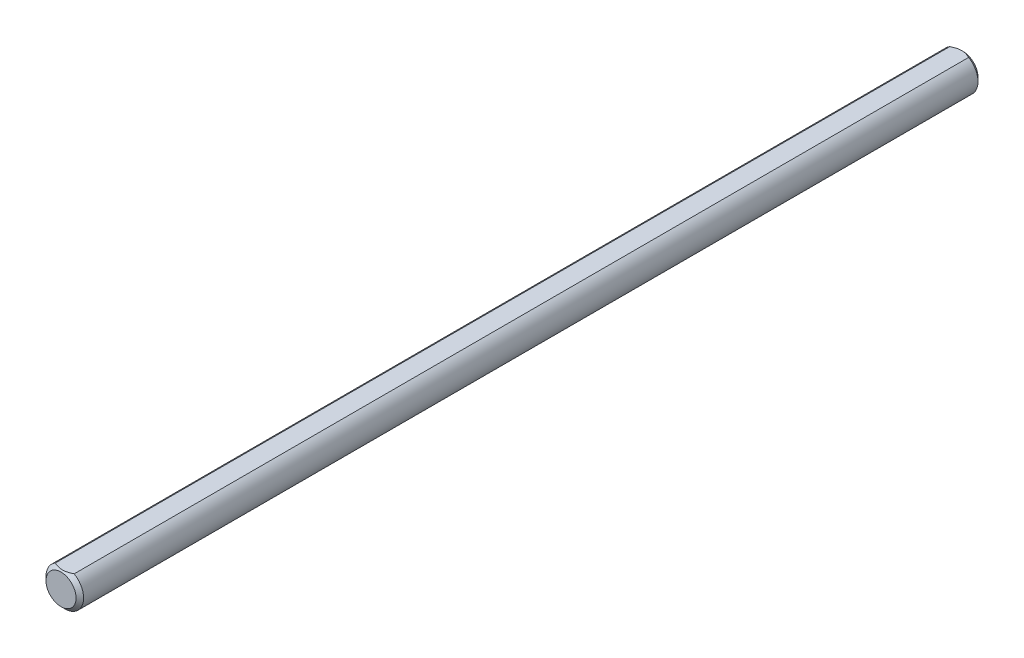
ISO-10303-21;
HEADER;
FILE_DESCRIPTION(('STEP AP214'),'2;1');
FILE_NAME('part.step','',(''),(''),'','','');
FILE_SCHEMA(('AUTOMOTIVE_DESIGN { 1 0 10303 214 1 1 1 1 }'));
ENDSEC;
DATA;
#1=APPLICATION_CONTEXT('core data for automotive mechanical design processes');
#2=APPLICATION_PROTOCOL_DEFINITION('international standard','automotive_design',2000,#1);
#3=PRODUCT_CONTEXT('',#1,'mechanical');
#4=PRODUCT('Part','Part','',(#3));
#5=PRODUCT_RELATED_PRODUCT_CATEGORY('part','',(#4));
#6=PRODUCT_DEFINITION_FORMATION('','',#4);
#7=PRODUCT_DEFINITION_CONTEXT('part definition',#1,'design');
#8=PRODUCT_DEFINITION('design','',#6,#7);
#9=PRODUCT_DEFINITION_SHAPE('','',#8);
#10=(LENGTH_UNIT() NAMED_UNIT(*) SI_UNIT(.MILLI.,.METRE.));
#11=(NAMED_UNIT(*) PLANE_ANGLE_UNIT() SI_UNIT($,.RADIAN.));
#12=(NAMED_UNIT(*) SI_UNIT($,.STERADIAN.) SOLID_ANGLE_UNIT());
#13=UNCERTAINTY_MEASURE_WITH_UNIT(LENGTH_MEASURE(1.E-05),#10,'distance_accuracy_value','');
#14=(GEOMETRIC_REPRESENTATION_CONTEXT(3) GLOBAL_UNCERTAINTY_ASSIGNED_CONTEXT((#13)) GLOBAL_UNIT_ASSIGNED_CONTEXT((#10,
#11,#12)) REPRESENTATION_CONTEXT('',''));
#15=CARTESIAN_POINT('',(0.,0.,0.));
#16=DIRECTION('',(0.,0.,1.));
#17=DIRECTION('',(1.,0.,0.));
#18=AXIS2_PLACEMENT_3D('',#15,#16,#17);
#19=CARTESIAN_POINT('',(0.,0.,152.4));
#20=DIRECTION('',(0.,0.,1.));
#21=DIRECTION('',(1.,0.,0.));
#22=AXIS2_PLACEMENT_3D('',#19,#20,#21);
#23=PLANE('',#22);
#24=CARTESIAN_POINT('',(0.,0.,152.4));
#25=DIRECTION('',(0.,0.,-1.));
#26=DIRECTION('',(-1.,0.,0.));
#27=AXIS2_PLACEMENT_3D('',#24,#25,#26);
#28=CIRCLE('',#27,5.08000000002085);
#29=CARTESIAN_POINT('',(-5.08000000002085,0.,152.4));
#30=VERTEX_POINT('',#29);
#31=EDGE_CURVE('E69',#30,#30,#28,.T.);
#32=ORIENTED_EDGE('',*,*,#31,.F.);
#33=EDGE_LOOP('',(#32));
#34=FACE_BOUND('',#33,.T.);
#35=ADVANCED_FACE('F18',(#34),#23,.T.);
#36=CARTESIAN_POINT('',(-3.175,5.49926131403118,-152.4));
#37=DIRECTION('',(0.,-1.,0.));
#38=DIRECTION('',(0.,0.,-1.));
#39=AXIS2_PLACEMENT_3D('',#36,#37,#38);
#40=PLANE('',#39);
#41=DIRECTION('',(0.,0.,-1.));
#42=VECTOR('',#41,1.);
#43=CARTESIAN_POINT('',(-3.175,5.49926131403118,152.4));
#44=LINE('',#43,#42);
#45=CARTESIAN_POINT('',(-3.17499999999278,5.49926131403118,151.129999999986));
#46=VERTEX_POINT('',#45);
#47=CARTESIAN_POINT('',(-3.17500000001147,5.49926131403118,-151.130000000033));
#48=VERTEX_POINT('',#47);
#49=EDGE_CURVE('E64',#46,#48,#44,.T.);
#50=ORIENTED_EDGE('',*,*,#49,.F.);
#51=CARTESIAN_POINT('',(3.17499999998556,5.49926131403118,151.129999999971));
#52=CARTESIAN_POINT('',(3.06582224123462,5.49926131403118,151.184580687039));
#53=CARTESIAN_POINT('',(2.95580532065341,5.49926131403118,151.237486270999));
#54=CARTESIAN_POINT('',(2.73392855594358,5.49926131403118,151.339437715292));
#55=CARTESIAN_POINT('',(2.62206774515666,5.49926131403118,151.388481467855));
#56=CARTESIAN_POINT('',(2.28243359865834,5.49926131403118,151.529473831666));
#57=CARTESIAN_POINT('',(2.05178528301454,5.49926131403118,151.614682188404));
#58=CARTESIAN_POINT('',(1.58666466159246,5.49926131403118,151.760595148938));
#59=CARTESIAN_POINT('',(1.35231120668174,5.49926131403118,151.82166731126));
#60=CARTESIAN_POINT('',(0.996928643232712,5.49926131403118,151.892312436909));
#61=CARTESIAN_POINT('',(0.877944621217785,5.49926131403118,151.912357514018));
#62=CARTESIAN_POINT('',(0.638969266910513,5.49926131403118,151.945006414228));
#63=CARTESIAN_POINT('',(0.51897808783385,5.49926131403118,151.957611349088));
#64=CARTESIAN_POINT('',(0.226565673507851,5.49926131403118,151.978745887672));
#65=CARTESIAN_POINT('',(0.0538293572723397,5.49926131403118,151.983179689027));
#66=CARTESIAN_POINT('',(-0.291331831873915,5.49926131403118,151.97573366432));
#67=CARTESIAN_POINT('',(-0.463756574413629,5.49926131403118,151.963848120183));
#68=CARTESIAN_POINT('',(-0.806980344369632,5.49926131403118,151.924464011978));
#69=CARTESIAN_POINT('',(-0.977777336704677,5.49926131403118,151.896947991802));
#70=CARTESIAN_POINT('',(-1.31643569556533,5.49926131403118,151.827798853937));
#71=CARTESIAN_POINT('',(-1.48429728619176,5.49926131403118,151.786166818915));
#72=CARTESIAN_POINT('',(-1.78226126433676,5.49926131403118,151.700523153688));
#73=CARTESIAN_POINT('',(-1.91302383332061,5.49926131403118,151.658765205639));
#74=CARTESIAN_POINT('',(-2.17220199281083,5.49926131403118,151.568521124862));
#75=CARTESIAN_POINT('',(-2.30061751242525,5.49926131403118,151.520034789285));
#76=CARTESIAN_POINT('',(-2.55469707230706,5.49926131403118,151.417420567503));
#77=CARTESIAN_POINT('',(-2.68036833830622,5.49926131403118,151.363310424551));
#78=CARTESIAN_POINT('',(-2.92938416729792,5.49926131403118,151.250158762808));
#79=CARTESIAN_POINT('',(-3.05273010019382,5.49926131403118,151.191120266261));
#80=CARTESIAN_POINT('',(-3.17499999998556,5.49926131403118,151.129999999971));
#81=B_SPLINE_CURVE_WITH_KNOTS('',3,(#51,#52,#53,#54,#55,#56,#57,#58,#59,#60,#61,#62,#63,#64,#65,
#66,#67,#68,#69,#70,#71,#72,#73,#74,#75,#76,#77,#78,#79,#80),.UNSPECIFIED.,.F.,.F.,(4,2,2,2,2,2,
2,2,2,2,2,2,2,2,4),(0.,0.366160918005269,0.732520319179626,1.46919363769064,2.19417107479299,
2.55594894319121,2.91767273846951,3.43524693043888,3.95300251953105,4.47133747776656,
4.98963268984637,5.40124433729582,5.81286839687703,6.22323107768345,6.63334393251401),.UNSPECIFIED.);
#82=CARTESIAN_POINT('',(3.17499999999278,5.49926131403118,151.129999999986));
#83=VERTEX_POINT('',#82);
#84=EDGE_CURVE('E21',#83,#46,#81,.T.);
#85=ORIENTED_EDGE('',*,*,#84,.F.);
#86=DIRECTION('',(0.,0.,-1.));
#87=VECTOR('',#86,1.);
#88=CARTESIAN_POINT('',(3.175,5.49926131403118,152.4));
#89=LINE('',#88,#87);
#90=CARTESIAN_POINT('',(3.17500000001147,5.49926131403118,-151.130000000033));
#91=VERTEX_POINT('',#90);
#92=EDGE_CURVE('E63',#91,#83,#89,.F.);
#93=ORIENTED_EDGE('',*,*,#92,.F.);
#94=CARTESIAN_POINT('',(-3.17500000002293,5.49926131403118,-151.130000000066));
#95=CARTESIAN_POINT('',(-3.06582224126242,5.49926131403118,-151.184580687134));
#96=CARTESIAN_POINT('',(-2.9558053206716,5.49926131403118,-151.237486271095));
#97=CARTESIAN_POINT('',(-2.73392855594251,5.49926131403118,-151.339437715387));
#98=CARTESIAN_POINT('',(-2.62206774514593,5.49926131403118,-151.388481467951));
#99=CARTESIAN_POINT('',(-2.2824335986185,5.49926131403118,-151.529473831759));
#100=CARTESIAN_POINT('',(-2.0517852829552,5.49926131403118,-151.614682188496));
#101=CARTESIAN_POINT('',(-1.58666466149496,5.49926131403118,-151.760595149023));
#102=CARTESIAN_POINT('',(-1.35231120656557,5.49926131403118,-151.821667311341));
#103=CARTESIAN_POINT('',(-0.996928643089042,5.49926131403118,-151.89231243698));
#104=CARTESIAN_POINT('',(-0.877944621065041,5.49926131403118,-151.912357514086));
#105=CARTESIAN_POINT('',(-0.638969266739833,5.49926131403118,-151.945006414289));
#106=CARTESIAN_POINT('',(-0.518978087654309,5.49926131403118,-151.957611349144));
#107=CARTESIAN_POINT('',(-0.226565673298807,5.49926131403118,-151.978745887719));
#108=CARTESIAN_POINT('',(-0.0538293570427386,5.49926131403118,-151.983179689068));
#109=CARTESIAN_POINT('',(0.291331832143883,5.49926131403118,-151.975733664344));
#110=CARTESIAN_POINT('',(0.463756574703407,5.49926131403118,-151.963848120199));
#111=CARTESIAN_POINT('',(0.806980344698153,5.49926131403118,-151.924464011973));
#112=CARTESIAN_POINT('',(0.97777733705213,5.49926131403118,-151.896947991787));
#113=CARTESIAN_POINT('',(1.31643569594981,5.49926131403118,-151.827798853899));
#114=CARTESIAN_POINT('',(1.48429728659434,5.49926131403118,-151.786166818865));
#115=CARTESIAN_POINT('',(1.7822612647224,5.49926131403118,-151.700523153631));
#116=CARTESIAN_POINT('',(1.91302383367218,5.49926131403118,-151.658765205589));
#117=CARTESIAN_POINT('',(2.17220199309568,5.49926131403118,-151.568521124831));
#118=CARTESIAN_POINT('',(2.30061751267745,5.49926131403118,-151.520034789266));
#119=CARTESIAN_POINT('',(2.55469707249533,5.49926131403118,-151.417420567511));
#120=CARTESIAN_POINT('',(2.68036833846322,5.49926131403118,-151.363310424574));
#121=CARTESIAN_POINT('',(2.92938416739397,5.49926131403118,-151.250158762866));
#122=CARTESIAN_POINT('',(3.05273010026019,5.49926131403118,-151.191120266336));
#123=CARTESIAN_POINT('',(3.17500000002293,5.49926131403118,-151.130000000066));
#124=B_SPLINE_CURVE_WITH_KNOTS('',3,(#94,#95,#96,#97,#98,#99,#100,#101,#102,#103,#104,#105,#106,
#107,#108,#109,#110,#111,#112,#113,#114,#115,#116,#117,#118,#119,#120,#121,#122,#123),
.UNSPECIFIED.,.F.,.F.,(4,2,2,2,2,2,2,2,2,2,2,2,2,2,4),(0.,0.366160918031475,0.732520319232085,
1.46919363779575,2.19417107494853,2.55594894337191,2.9176727386754,3.43524693070574,
3.95300251985896,4.47133747815565,4.98963269029662,5.40124433764236,5.81286839711964,
6.22323107782166,6.63334393254831),.UNSPECIFIED.);
#125=EDGE_CURVE('E66',#48,#91,#124,.T.);
#126=ORIENTED_EDGE('',*,*,#125,.F.);
#127=EDGE_LOOP('',(#50,#85,#93,#126));
#128=FACE_BOUND('',#127,.T.);
#129=ADVANCED_FACE('F62',(#128),#40,.F.);
#130=CARTESIAN_POINT('',(0.,0.,-152.4));
#131=DIRECTION('',(0.,0.,1.));
#132=DIRECTION('',(1.,0.,0.));
#133=AXIS2_PLACEMENT_3D('',#130,#131,#132);
#134=PLANE('',#133);
#135=CARTESIAN_POINT('',(0.,0.,-152.4));
#136=DIRECTION('',(0.,0.,1.));
#137=DIRECTION('',(1.,0.,0.));
#138=AXIS2_PLACEMENT_3D('',#135,#136,#137);
#139=CIRCLE('',#138,5.08000000002085);
#140=CARTESIAN_POINT('',(5.08000000002085,0.,-152.4));
#141=VERTEX_POINT('',#140);
#142=EDGE_CURVE('E58',#141,#141,#139,.T.);
#143=ORIENTED_EDGE('',*,*,#142,.F.);
#144=EDGE_LOOP('',(#143));
#145=FACE_BOUND('',#144,.T.);
#146=ADVANCED_FACE('F95',(#145),#134,.F.);
#147=CARTESIAN_POINT('',(0.,0.,151.13000000008));
#148=DIRECTION('',(0.,0.,-1.));
#149=DIRECTION('',(-1.,0.,0.));
#150=AXIS2_PLACEMENT_3D('',#147,#148,#149);
#151=CONICAL_SURFACE('',#150,6.34999999988395,0.785398163375069);
#152=ORIENTED_EDGE('',*,*,#31,.T.);
#153=EDGE_LOOP('',(#152));
#154=FACE_BOUND('',#153,.T.);
#155=CARTESIAN_POINT('',(0.,0.,151.13));
#156=DIRECTION('',(0.,0.,-1.));
#157=DIRECTION('',(-1.,0.,0.));
#158=AXIS2_PLACEMENT_3D('',#155,#156,#157);
#159=CIRCLE('',#158,6.35);
#160=EDGE_CURVE('E32',#83,#46,#159,.T.);
#161=ORIENTED_EDGE('',*,*,#160,.F.);
#162=ORIENTED_EDGE('',*,*,#84,.T.);
#163=EDGE_LOOP('',(#161,#162));
#164=FACE_BOUND('',#163,.T.);
#165=ADVANCED_FACE('F52',(#154,#164),#151,.T.);
#166=CARTESIAN_POINT('',(0.,0.,-151.13000000008));
#167=DIRECTION('',(0.,0.,1.));
#168=DIRECTION('',(1.,0.,0.));
#169=AXIS2_PLACEMENT_3D('',#166,#167,#168);
#170=CONICAL_SURFACE('',#169,6.34999999999764,0.785398163419828);
#171=ORIENTED_EDGE('',*,*,#142,.T.);
#172=EDGE_LOOP('',(#171));
#173=FACE_BOUND('',#172,.T.);
#174=CARTESIAN_POINT('',(0.,0.,-151.13));
#175=DIRECTION('',(0.,0.,-1.));
#176=DIRECTION('',(-1.,0.,0.));
#177=AXIS2_PLACEMENT_3D('',#174,#175,#176);
#178=CIRCLE('',#177,6.35);
#179=EDGE_CURVE('E11',#48,#91,#178,.F.);
#180=ORIENTED_EDGE('',*,*,#179,.F.);
#181=ORIENTED_EDGE('',*,*,#125,.T.);
#182=EDGE_LOOP('',(#180,#181));
#183=FACE_BOUND('',#182,.T.);
#184=ADVANCED_FACE('F88',(#173,#183),#170,.T.);
#185=CARTESIAN_POINT('',(0.,0.,152.4));
#186=DIRECTION('',(0.,0.,-1.));
#187=DIRECTION('',(-1.,0.,0.));
#188=AXIS2_PLACEMENT_3D('',#185,#186,#187);
#189=CYLINDRICAL_SURFACE('',#188,6.35);
#190=ORIENTED_EDGE('',*,*,#160,.T.);
#191=ORIENTED_EDGE('',*,*,#49,.T.);
#192=ORIENTED_EDGE('',*,*,#179,.T.);
#193=ORIENTED_EDGE('',*,*,#92,.T.);
#194=EDGE_LOOP('',(#190,#191,#192,#193));
#195=FACE_BOUND('',#194,.T.);
#196=ADVANCED_FACE('F67',(#195),#189,.T.);
#197=CLOSED_SHELL('',(#35,#129,#146,#165,#184,#196));
#198=MANIFOLD_SOLID_BREP('B1',#197);
#199=ADVANCED_BREP_SHAPE_REPRESENTATION('',(#18,#198),#14);
#200=SHAPE_DEFINITION_REPRESENTATION(#9,#199);
ENDSEC;
END-ISO-10303-21;
